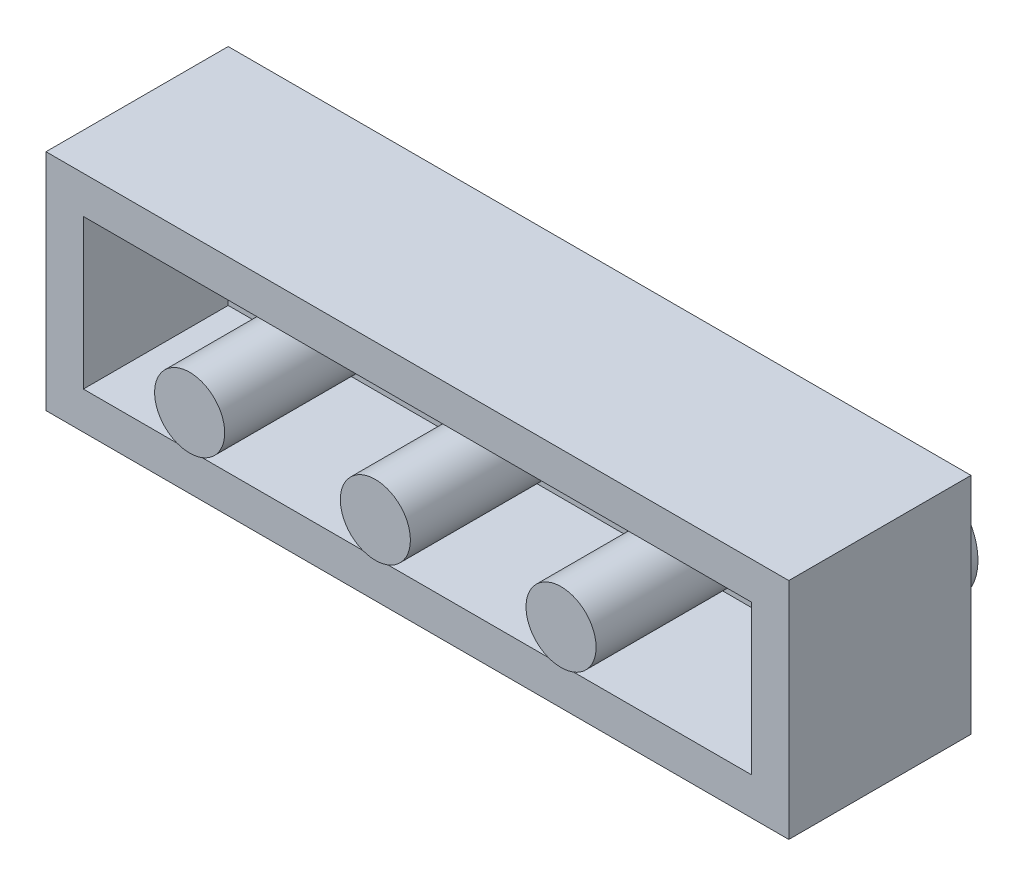
ISO-10303-21;
HEADER;
FILE_DESCRIPTION(('STEP AP214'),'2;1');
FILE_NAME('part.step','',(''),(''),'','','');
FILE_SCHEMA(('AUTOMOTIVE_DESIGN { 1 0 10303 214 1 1 1 1 }'));
ENDSEC;
DATA;
#1=APPLICATION_CONTEXT('core data for automotive mechanical design processes');
#2=APPLICATION_PROTOCOL_DEFINITION('international standard','automotive_design',2000,#1);
#3=PRODUCT_CONTEXT('',#1,'mechanical');
#4=PRODUCT('Part','Part','',(#3));
#5=PRODUCT_RELATED_PRODUCT_CATEGORY('part','',(#4));
#6=PRODUCT_DEFINITION_FORMATION('','',#4);
#7=PRODUCT_DEFINITION_CONTEXT('part definition',#1,'design');
#8=PRODUCT_DEFINITION('design','',#6,#7);
#9=PRODUCT_DEFINITION_SHAPE('','',#8);
#10=(LENGTH_UNIT() NAMED_UNIT(*) SI_UNIT(.MILLI.,.METRE.));
#11=(NAMED_UNIT(*) PLANE_ANGLE_UNIT() SI_UNIT($,.RADIAN.));
#12=(NAMED_UNIT(*) SI_UNIT($,.STERADIAN.) SOLID_ANGLE_UNIT());
#13=UNCERTAINTY_MEASURE_WITH_UNIT(LENGTH_MEASURE(1.E-05),#10,'distance_accuracy_value','');
#14=(GEOMETRIC_REPRESENTATION_CONTEXT(3) GLOBAL_UNCERTAINTY_ASSIGNED_CONTEXT((#13)) GLOBAL_UNIT_ASSIGNED_CONTEXT((#10,
#11,#12)) REPRESENTATION_CONTEXT('',''));
#15=CARTESIAN_POINT('',(0.,0.,0.));
#16=DIRECTION('',(0.,0.,1.));
#17=DIRECTION('',(1.,0.,0.));
#18=AXIS2_PLACEMENT_3D('',#15,#16,#17);
#19=CARTESIAN_POINT('',(12.,0.,-5.7));
#20=DIRECTION('',(0.,0.,-1.));
#21=DIRECTION('',(-1.,0.,0.));
#22=AXIS2_PLACEMENT_3D('',#19,#20,#21);
#23=PLANE('',#22);
#24=CARTESIAN_POINT('',(12.,0.,-5.7));
#25=DIRECTION('',(0.,0.,-1.));
#26=DIRECTION('',(-1.,0.,0.));
#27=AXIS2_PLACEMENT_3D('',#24,#25,#26);
#28=CIRCLE('',#27,2.4);
#29=CARTESIAN_POINT('',(9.6,0.,-5.7));
#30=VERTEX_POINT('',#29);
#31=EDGE_CURVE('E11',#30,#30,#28,.T.);
#32=ORIENTED_EDGE('',*,*,#31,.T.);
#33=EDGE_LOOP('',(#32));
#34=FACE_BOUND('',#33,.T.);
#35=ADVANCED_FACE('F35',(#34),#23,.T.);
#36=CARTESIAN_POINT('',(12.,0.,-5.7));
#37=DIRECTION('',(0.,0.,1.));
#38=DIRECTION('',(1.,0.,0.));
#39=AXIS2_PLACEMENT_3D('',#36,#37,#38);
#40=CYLINDRICAL_SURFACE('',#39,2.4);
#41=ORIENTED_EDGE('',*,*,#31,.F.);
#42=EDGE_LOOP('',(#41));
#43=FACE_BOUND('',#42,.T.);
#44=CARTESIAN_POINT('',(12.,0.,-3.9));
#45=DIRECTION('',(0.,0.,1.));
#46=DIRECTION('',(1.,0.,0.));
#47=AXIS2_PLACEMENT_3D('',#44,#45,#46);
#48=CIRCLE('',#47,2.4);
#49=CARTESIAN_POINT('',(14.4,0.,-3.9));
#50=VERTEX_POINT('',#49);
#51=EDGE_CURVE('E42',#50,#50,#48,.F.);
#52=ORIENTED_EDGE('',*,*,#51,.T.);
#53=EDGE_LOOP('',(#52));
#54=FACE_BOUND('',#53,.T.);
#55=ADVANCED_FACE('F183',(#43,#54),#40,.T.);
#56=CARTESIAN_POINT('',(4.,0.,-5.7));
#57=DIRECTION('',(0.,0.,-1.));
#58=DIRECTION('',(-1.,0.,0.));
#59=AXIS2_PLACEMENT_3D('',#56,#57,#58);
#60=PLANE('',#59);
#61=CARTESIAN_POINT('',(4.,0.,-5.7));
#62=DIRECTION('',(0.,0.,-1.));
#63=DIRECTION('',(-1.,0.,0.));
#64=AXIS2_PLACEMENT_3D('',#61,#62,#63);
#65=CIRCLE('',#64,2.4);
#66=CARTESIAN_POINT('',(1.6,0.,-5.7));
#67=VERTEX_POINT('',#66);
#68=EDGE_CURVE('E178',#67,#67,#65,.T.);
#69=ORIENTED_EDGE('',*,*,#68,.T.);
#70=EDGE_LOOP('',(#69));
#71=FACE_BOUND('',#70,.T.);
#72=ADVANCED_FACE('F208',(#71),#60,.T.);
#73=CARTESIAN_POINT('',(4.,0.,-5.7));
#74=DIRECTION('',(0.,0.,1.));
#75=DIRECTION('',(1.,0.,0.));
#76=AXIS2_PLACEMENT_3D('',#73,#74,#75);
#77=CYLINDRICAL_SURFACE('',#76,2.4);
#78=ORIENTED_EDGE('',*,*,#68,.F.);
#79=EDGE_LOOP('',(#78));
#80=FACE_BOUND('',#79,.T.);
#81=CARTESIAN_POINT('',(4.,0.,-3.9));
#82=DIRECTION('',(0.,0.,1.));
#83=DIRECTION('',(1.,0.,0.));
#84=AXIS2_PLACEMENT_3D('',#81,#82,#83);
#85=CIRCLE('',#84,2.4);
#86=CARTESIAN_POINT('',(6.4,0.,-3.9));
#87=VERTEX_POINT('',#86);
#88=EDGE_CURVE('E175',#87,#87,#85,.F.);
#89=ORIENTED_EDGE('',*,*,#88,.T.);
#90=EDGE_LOOP('',(#89));
#91=FACE_BOUND('',#90,.T.);
#92=ADVANCED_FACE('F214',(#80,#91),#77,.T.);
#93=CARTESIAN_POINT('',(-15.9,4.8,3.9));
#94=DIRECTION('',(0.,0.,-1.));
#95=DIRECTION('',(-1.,0.,0.));
#96=AXIS2_PLACEMENT_3D('',#93,#94,#95);
#97=PLANE('',#96);
#98=DIRECTION('',(1.,0.,0.));
#99=VECTOR('',#98,1.);
#100=CARTESIAN_POINT('',(-15.9,-4.8,3.9));
#101=LINE('',#100,#99);
#102=CARTESIAN_POINT('',(-15.9,-4.8,3.9));
#103=VERTEX_POINT('',#102);
#104=CARTESIAN_POINT('',(15.9,-4.8,3.9));
#105=VERTEX_POINT('',#104);
#106=EDGE_CURVE('E79',#103,#105,#101,.T.);
#107=ORIENTED_EDGE('',*,*,#106,.T.);
#108=DIRECTION('',(0.,-1.,0.));
#109=VECTOR('',#108,1.);
#110=CARTESIAN_POINT('',(15.9,4.8,3.9));
#111=LINE('',#110,#109);
#112=CARTESIAN_POINT('',(15.9,4.8,3.9));
#113=VERTEX_POINT('',#112);
#114=EDGE_CURVE('E152',#113,#105,#111,.T.);
#115=ORIENTED_EDGE('',*,*,#114,.F.);
#116=DIRECTION('',(1.,0.,0.));
#117=VECTOR('',#116,1.);
#118=CARTESIAN_POINT('',(-15.9,4.8,3.9));
#119=LINE('',#118,#117);
#120=CARTESIAN_POINT('',(-15.9,4.8,3.9));
#121=VERTEX_POINT('',#120);
#122=EDGE_CURVE('E58',#121,#113,#119,.T.);
#123=ORIENTED_EDGE('',*,*,#122,.F.);
#124=DIRECTION('',(0.,-1.,0.));
#125=VECTOR('',#124,1.);
#126=CARTESIAN_POINT('',(-15.9,4.8,3.9));
#127=LINE('',#126,#125);
#128=EDGE_CURVE('E162',#121,#103,#127,.T.);
#129=ORIENTED_EDGE('',*,*,#128,.T.);
#130=EDGE_LOOP('',(#107,#115,#123,#129));
#131=FACE_BOUND('',#130,.T.);
#132=DIRECTION('',(1.,0.,0.));
#133=VECTOR('',#132,1.);
#134=CARTESIAN_POINT('',(-15.9,-3.2,3.9));
#135=LINE('',#134,#133);
#136=CARTESIAN_POINT('',(-14.3,-3.2,3.9));
#137=VERTEX_POINT('',#136);
#138=CARTESIAN_POINT('',(14.3,-3.2,3.9));
#139=VERTEX_POINT('',#138);
#140=EDGE_CURVE('E133',#137,#139,#135,.T.);
#141=ORIENTED_EDGE('',*,*,#140,.F.);
#142=DIRECTION('',(0.,-1.,0.));
#143=VECTOR('',#142,1.);
#144=CARTESIAN_POINT('',(-14.3,4.8,3.9));
#145=LINE('',#144,#143);
#146=CARTESIAN_POINT('',(-14.3,3.2,3.9));
#147=VERTEX_POINT('',#146);
#148=EDGE_CURVE('E128',#147,#137,#145,.T.);
#149=ORIENTED_EDGE('',*,*,#148,.F.);
#150=DIRECTION('',(1.,0.,0.));
#151=VECTOR('',#150,1.);
#152=CARTESIAN_POINT('',(-15.9,3.2,3.9));
#153=LINE('',#152,#151);
#154=CARTESIAN_POINT('',(14.3,3.2,3.9));
#155=VERTEX_POINT('',#154);
#156=EDGE_CURVE('E49',#147,#155,#153,.T.);
#157=ORIENTED_EDGE('',*,*,#156,.T.);
#158=DIRECTION('',(0.,-1.,0.));
#159=VECTOR('',#158,1.);
#160=CARTESIAN_POINT('',(14.3,4.8,3.9));
#161=LINE('',#160,#159);
#162=EDGE_CURVE('E141',#155,#139,#161,.T.);
#163=ORIENTED_EDGE('',*,*,#162,.T.);
#164=EDGE_LOOP('',(#141,#149,#157,#163));
#165=FACE_BOUND('',#164,.T.);
#166=ADVANCED_FACE('F198',(#131,#165),#97,.F.);
#167=CARTESIAN_POINT('',(15.9,4.8,-3.9));
#168=DIRECTION('',(-1.,0.,0.));
#169=DIRECTION('',(0.,0.,1.));
#170=AXIS2_PLACEMENT_3D('',#167,#168,#169);
#171=PLANE('',#170);
#172=DIRECTION('',(0.,0.,-1.));
#173=VECTOR('',#172,1.);
#174=CARTESIAN_POINT('',(15.9,-4.8,-3.9));
#175=LINE('',#174,#173);
#176=CARTESIAN_POINT('',(15.9,-4.8,-3.9));
#177=VERTEX_POINT('',#176);
#178=EDGE_CURVE('E153',#105,#177,#175,.T.);
#179=ORIENTED_EDGE('',*,*,#178,.T.);
#180=DIRECTION('',(0.,-1.,0.));
#181=VECTOR('',#180,1.);
#182=CARTESIAN_POINT('',(15.9,4.8,-3.9));
#183=LINE('',#182,#181);
#184=CARTESIAN_POINT('',(15.9,4.8,-3.9));
#185=VERTEX_POINT('',#184);
#186=EDGE_CURVE('E167',#185,#177,#183,.T.);
#187=ORIENTED_EDGE('',*,*,#186,.F.);
#188=DIRECTION('',(0.,0.,-1.));
#189=VECTOR('',#188,1.);
#190=CARTESIAN_POINT('',(15.9,4.8,-3.9));
#191=LINE('',#190,#189);
#192=EDGE_CURVE('E146',#113,#185,#191,.T.);
#193=ORIENTED_EDGE('',*,*,#192,.F.);
#194=ORIENTED_EDGE('',*,*,#114,.T.);
#195=EDGE_LOOP('',(#179,#187,#193,#194));
#196=FACE_BOUND('',#195,.T.);
#197=ADVANCED_FACE('F188',(#196),#171,.F.);
#198=CARTESIAN_POINT('',(-15.9,4.8,-3.9));
#199=DIRECTION('',(0.,0.,1.));
#200=DIRECTION('',(1.,0.,0.));
#201=AXIS2_PLACEMENT_3D('',#198,#199,#200);
#202=PLANE('',#201);
#203=CARTESIAN_POINT('',(-4.,0.,-3.9));
#204=DIRECTION('',(0.,0.,1.));
#205=DIRECTION('',(1.,0.,0.));
#206=AXIS2_PLACEMENT_3D('',#203,#204,#205);
#207=CIRCLE('',#206,2.4);
#208=CARTESIAN_POINT('',(-1.6,0.,-3.9));
#209=VERTEX_POINT('',#208);
#210=EDGE_CURVE('E172',#209,#209,#207,.F.);
#211=ORIENTED_EDGE('',*,*,#210,.F.);
#212=EDGE_LOOP('',(#211));
#213=FACE_BOUND('',#212,.T.);
#214=CARTESIAN_POINT('',(-12.,0.,-3.9));
#215=DIRECTION('',(0.,0.,1.));
#216=DIRECTION('',(1.,0.,0.));
#217=AXIS2_PLACEMENT_3D('',#214,#215,#216);
#218=CIRCLE('',#217,2.4);
#219=CARTESIAN_POINT('',(-9.6,0.,-3.9));
#220=VERTEX_POINT('',#219);
#221=EDGE_CURVE('E169',#220,#220,#218,.F.);
#222=ORIENTED_EDGE('',*,*,#221,.F.);
#223=EDGE_LOOP('',(#222));
#224=FACE_BOUND('',#223,.T.);
#225=DIRECTION('',(-1.,0.,0.));
#226=VECTOR('',#225,1.);
#227=CARTESIAN_POINT('',(-15.9,-4.8,-3.9));
#228=LINE('',#227,#226);
#229=CARTESIAN_POINT('',(-15.9,-4.8,-3.9));
#230=VERTEX_POINT('',#229);
#231=EDGE_CURVE('E156',#177,#230,#228,.T.);
#232=ORIENTED_EDGE('',*,*,#231,.T.);
#233=DIRECTION('',(0.,-1.,0.));
#234=VECTOR('',#233,1.);
#235=CARTESIAN_POINT('',(-15.9,4.8,-3.9));
#236=LINE('',#235,#234);
#237=CARTESIAN_POINT('',(-15.9,4.8,-3.9));
#238=VERTEX_POINT('',#237);
#239=EDGE_CURVE('E164',#238,#230,#236,.T.);
#240=ORIENTED_EDGE('',*,*,#239,.F.);
#241=DIRECTION('',(-1.,0.,0.));
#242=VECTOR('',#241,1.);
#243=CARTESIAN_POINT('',(-15.9,4.8,-3.9));
#244=LINE('',#243,#242);
#245=EDGE_CURVE('E87',#185,#238,#244,.T.);
#246=ORIENTED_EDGE('',*,*,#245,.F.);
#247=ORIENTED_EDGE('',*,*,#186,.T.);
#248=EDGE_LOOP('',(#232,#240,#246,#247));
#249=FACE_BOUND('',#248,.T.);
#250=ORIENTED_EDGE('',*,*,#88,.F.);
#251=EDGE_LOOP('',(#250));
#252=FACE_BOUND('',#251,.T.);
#253=ORIENTED_EDGE('',*,*,#51,.F.);
#254=EDGE_LOOP('',(#253));
#255=FACE_BOUND('',#254,.T.);
#256=ADVANCED_FACE('F185',(#213,#224,#249,#252,#255),#202,.F.);
#257=CARTESIAN_POINT('',(-15.9,4.8,-3.9));
#258=DIRECTION('',(1.,0.,0.));
#259=DIRECTION('',(0.,0.,-1.));
#260=AXIS2_PLACEMENT_3D('',#257,#258,#259);
#261=PLANE('',#260);
#262=DIRECTION('',(0.,0.,1.));
#263=VECTOR('',#262,1.);
#264=CARTESIAN_POINT('',(-15.9,-4.8,-3.9));
#265=LINE('',#264,#263);
#266=EDGE_CURVE('E158',#230,#103,#265,.T.);
#267=ORIENTED_EDGE('',*,*,#266,.T.);
#268=ORIENTED_EDGE('',*,*,#128,.F.);
#269=DIRECTION('',(0.,0.,1.));
#270=VECTOR('',#269,1.);
#271=CARTESIAN_POINT('',(-15.9,4.8,-3.9));
#272=LINE('',#271,#270);
#273=EDGE_CURVE('E149',#238,#121,#272,.T.);
#274=ORIENTED_EDGE('',*,*,#273,.F.);
#275=ORIENTED_EDGE('',*,*,#239,.T.);
#276=EDGE_LOOP('',(#267,#268,#274,#275));
#277=FACE_BOUND('',#276,.T.);
#278=ADVANCED_FACE('F187',(#277),#261,.F.);
#279=CARTESIAN_POINT('',(0.,4.8,0.));
#280=DIRECTION('',(0.,1.,0.));
#281=DIRECTION('',(0.,0.,1.));
#282=AXIS2_PLACEMENT_3D('',#279,#280,#281);
#283=PLANE('',#282);
#284=ORIENTED_EDGE('',*,*,#192,.T.);
#285=ORIENTED_EDGE('',*,*,#245,.T.);
#286=ORIENTED_EDGE('',*,*,#273,.T.);
#287=ORIENTED_EDGE('',*,*,#122,.T.);
#288=EDGE_LOOP('',(#284,#285,#286,#287));
#289=FACE_BOUND('',#288,.T.);
#290=ADVANCED_FACE('F195',(#289),#283,.T.);
#291=CARTESIAN_POINT('',(0.,-4.8,0.));
#292=DIRECTION('',(0.,1.,0.));
#293=DIRECTION('',(0.,0.,1.));
#294=AXIS2_PLACEMENT_3D('',#291,#292,#293);
#295=PLANE('',#294);
#296=ORIENTED_EDGE('',*,*,#178,.F.);
#297=ORIENTED_EDGE('',*,*,#106,.F.);
#298=ORIENTED_EDGE('',*,*,#266,.F.);
#299=ORIENTED_EDGE('',*,*,#231,.F.);
#300=EDGE_LOOP('',(#296,#297,#298,#299));
#301=FACE_BOUND('',#300,.T.);
#302=ADVANCED_FACE('F232',(#301),#295,.F.);
#303=CARTESIAN_POINT('',(14.3,4.8,-3.9));
#304=DIRECTION('',(-1.,0.,0.));
#305=DIRECTION('',(0.,0.,1.));
#306=AXIS2_PLACEMENT_3D('',#303,#304,#305);
#307=PLANE('',#306);
#308=DIRECTION('',(0.,0.,-1.));
#309=VECTOR('',#308,1.);
#310=CARTESIAN_POINT('',(14.3,-3.2,-3.9));
#311=LINE('',#310,#309);
#312=CARTESIAN_POINT('',(14.3,-3.2,-2.3));
#313=VERTEX_POINT('',#312);
#314=EDGE_CURVE('E117',#139,#313,#311,.T.);
#315=ORIENTED_EDGE('',*,*,#314,.F.);
#316=ORIENTED_EDGE('',*,*,#162,.F.);
#317=DIRECTION('',(0.,0.,-1.));
#318=VECTOR('',#317,1.);
#319=CARTESIAN_POINT('',(14.3,3.2,-3.9));
#320=LINE('',#319,#318);
#321=CARTESIAN_POINT('',(14.3,3.2,-2.3));
#322=VERTEX_POINT('',#321);
#323=EDGE_CURVE('E135',#155,#322,#320,.T.);
#324=ORIENTED_EDGE('',*,*,#323,.T.);
#325=DIRECTION('',(0.,-1.,0.));
#326=VECTOR('',#325,1.);
#327=CARTESIAN_POINT('',(14.3,4.8,-2.3));
#328=LINE('',#327,#326);
#329=EDGE_CURVE('E127',#322,#313,#328,.T.);
#330=ORIENTED_EDGE('',*,*,#329,.T.);
#331=EDGE_LOOP('',(#315,#316,#324,#330));
#332=FACE_BOUND('',#331,.T.);
#333=ADVANCED_FACE('F235',(#332),#307,.T.);
#334=CARTESIAN_POINT('',(-15.9,4.8,-2.3));
#335=DIRECTION('',(0.,0.,1.));
#336=DIRECTION('',(1.,0.,0.));
#337=AXIS2_PLACEMENT_3D('',#334,#335,#336);
#338=PLANE('',#337);
#339=CARTESIAN_POINT('',(7.95,0.,-2.3));
#340=DIRECTION('',(0.,0.,1.));
#341=DIRECTION('',(1.,0.,0.));
#342=AXIS2_PLACEMENT_3D('',#339,#340,#341);
#343=CIRCLE('',#342,1.5);
#344=CARTESIAN_POINT('',(9.45,0.,-2.3));
#345=VERTEX_POINT('',#344);
#346=EDGE_CURVE('E297',#345,#345,#343,.T.);
#347=ORIENTED_EDGE('',*,*,#346,.F.);
#348=EDGE_LOOP('',(#347));
#349=FACE_BOUND('',#348,.T.);
#350=CARTESIAN_POINT('',(0.,0.,-2.3));
#351=DIRECTION('',(0.,0.,1.));
#352=DIRECTION('',(1.,0.,0.));
#353=AXIS2_PLACEMENT_3D('',#350,#351,#352);
#354=CIRCLE('',#353,1.5);
#355=CARTESIAN_POINT('',(1.5,0.,-2.3));
#356=VERTEX_POINT('',#355);
#357=EDGE_CURVE('E296',#356,#356,#354,.T.);
#358=ORIENTED_EDGE('',*,*,#357,.F.);
#359=EDGE_LOOP('',(#358));
#360=FACE_BOUND('',#359,.T.);
#361=CARTESIAN_POINT('',(-7.95,0.,-2.3));
#362=DIRECTION('',(0.,0.,1.));
#363=DIRECTION('',(1.,0.,0.));
#364=AXIS2_PLACEMENT_3D('',#361,#362,#363);
#365=CIRCLE('',#364,1.5);
#366=CARTESIAN_POINT('',(-6.45,0.,-2.3));
#367=VERTEX_POINT('',#366);
#368=EDGE_CURVE('E306',#367,#367,#365,.T.);
#369=ORIENTED_EDGE('',*,*,#368,.F.);
#370=EDGE_LOOP('',(#369));
#371=FACE_BOUND('',#370,.T.);
#372=DIRECTION('',(-1.,0.,0.));
#373=VECTOR('',#372,1.);
#374=CARTESIAN_POINT('',(-15.9,-3.2,-2.3));
#375=LINE('',#374,#373);
#376=CARTESIAN_POINT('',(-14.3,-3.2,-2.3));
#377=VERTEX_POINT('',#376);
#378=EDGE_CURVE('E110',#313,#377,#375,.T.);
#379=ORIENTED_EDGE('',*,*,#378,.F.);
#380=ORIENTED_EDGE('',*,*,#329,.F.);
#381=DIRECTION('',(-1.,0.,0.));
#382=VECTOR('',#381,1.);
#383=CARTESIAN_POINT('',(-15.9,3.2,-2.3));
#384=LINE('',#383,#382);
#385=CARTESIAN_POINT('',(-14.3,3.2,-2.3));
#386=VERTEX_POINT('',#385);
#387=EDGE_CURVE('E125',#322,#386,#384,.T.);
#388=ORIENTED_EDGE('',*,*,#387,.T.);
#389=DIRECTION('',(0.,-1.,0.));
#390=VECTOR('',#389,1.);
#391=CARTESIAN_POINT('',(-14.3,4.8,-2.3));
#392=LINE('',#391,#390);
#393=EDGE_CURVE('E123',#386,#377,#392,.T.);
#394=ORIENTED_EDGE('',*,*,#393,.T.);
#395=EDGE_LOOP('',(#379,#380,#388,#394));
#396=FACE_BOUND('',#395,.T.);
#397=ADVANCED_FACE('F124',(#349,#360,#371,#396),#338,.T.);
#398=CARTESIAN_POINT('',(-14.3,4.8,-3.9));
#399=DIRECTION('',(1.,0.,0.));
#400=DIRECTION('',(0.,0.,-1.));
#401=AXIS2_PLACEMENT_3D('',#398,#399,#400);
#402=PLANE('',#401);
#403=DIRECTION('',(0.,0.,1.));
#404=VECTOR('',#403,1.);
#405=CARTESIAN_POINT('',(-14.3,-3.2,-3.9));
#406=LINE('',#405,#404);
#407=EDGE_CURVE('E114',#377,#137,#406,.T.);
#408=ORIENTED_EDGE('',*,*,#407,.F.);
#409=ORIENTED_EDGE('',*,*,#393,.F.);
#410=DIRECTION('',(0.,0.,1.));
#411=VECTOR('',#410,1.);
#412=CARTESIAN_POINT('',(-14.3,3.2,-3.9));
#413=LINE('',#412,#411);
#414=EDGE_CURVE('E139',#386,#147,#413,.T.);
#415=ORIENTED_EDGE('',*,*,#414,.T.);
#416=ORIENTED_EDGE('',*,*,#148,.T.);
#417=EDGE_LOOP('',(#408,#409,#415,#416));
#418=FACE_BOUND('',#417,.T.);
#419=ADVANCED_FACE('F130',(#418),#402,.T.);
#420=CARTESIAN_POINT('',(0.,3.2,0.));
#421=DIRECTION('',(0.,1.,0.));
#422=DIRECTION('',(0.,0.,1.));
#423=AXIS2_PLACEMENT_3D('',#420,#421,#422);
#424=PLANE('',#423);
#425=ORIENTED_EDGE('',*,*,#323,.F.);
#426=ORIENTED_EDGE('',*,*,#156,.F.);
#427=ORIENTED_EDGE('',*,*,#414,.F.);
#428=ORIENTED_EDGE('',*,*,#387,.F.);
#429=EDGE_LOOP('',(#425,#426,#427,#428));
#430=FACE_BOUND('',#429,.T.);
#431=ADVANCED_FACE('F242',(#430),#424,.F.);
#432=CARTESIAN_POINT('',(0.,-3.2,0.));
#433=DIRECTION('',(0.,1.,0.));
#434=DIRECTION('',(0.,0.,1.));
#435=AXIS2_PLACEMENT_3D('',#432,#433,#434);
#436=PLANE('',#435);
#437=ORIENTED_EDGE('',*,*,#314,.T.);
#438=ORIENTED_EDGE('',*,*,#378,.T.);
#439=ORIENTED_EDGE('',*,*,#407,.T.);
#440=ORIENTED_EDGE('',*,*,#140,.T.);
#441=EDGE_LOOP('',(#437,#438,#439,#440));
#442=FACE_BOUND('',#441,.T.);
#443=ADVANCED_FACE('F112',(#442),#436,.T.);
#444=CARTESIAN_POINT('',(-12.,0.,-5.7));
#445=DIRECTION('',(0.,0.,1.));
#446=DIRECTION('',(1.,0.,0.));
#447=AXIS2_PLACEMENT_3D('',#444,#445,#446);
#448=CYLINDRICAL_SURFACE('',#447,2.4);
#449=CARTESIAN_POINT('',(-12.,0.,-5.7));
#450=DIRECTION('',(0.,0.,-1.));
#451=DIRECTION('',(-1.,0.,0.));
#452=AXIS2_PLACEMENT_3D('',#449,#450,#451);
#453=CIRCLE('',#452,2.4);
#454=CARTESIAN_POINT('',(-14.4,0.,-5.7));
#455=VERTEX_POINT('',#454);
#456=EDGE_CURVE('E316',#455,#455,#453,.T.);
#457=ORIENTED_EDGE('',*,*,#456,.F.);
#458=EDGE_LOOP('',(#457));
#459=FACE_BOUND('',#458,.T.);
#460=ORIENTED_EDGE('',*,*,#221,.T.);
#461=EDGE_LOOP('',(#460));
#462=FACE_BOUND('',#461,.T.);
#463=ADVANCED_FACE('F241',(#459,#462),#448,.T.);
#464=CARTESIAN_POINT('',(-12.,0.,-5.7));
#465=DIRECTION('',(0.,0.,-1.));
#466=DIRECTION('',(-1.,0.,0.));
#467=AXIS2_PLACEMENT_3D('',#464,#465,#466);
#468=PLANE('',#467);
#469=ORIENTED_EDGE('',*,*,#456,.T.);
#470=EDGE_LOOP('',(#469));
#471=FACE_BOUND('',#470,.T.);
#472=ADVANCED_FACE('F255',(#471),#468,.T.);
#473=CARTESIAN_POINT('',(-4.,0.,-5.7));
#474=DIRECTION('',(0.,0.,1.));
#475=DIRECTION('',(1.,0.,0.));
#476=AXIS2_PLACEMENT_3D('',#473,#474,#475);
#477=CYLINDRICAL_SURFACE('',#476,2.4);
#478=CARTESIAN_POINT('',(-4.,0.,-5.7));
#479=DIRECTION('',(0.,0.,-1.));
#480=DIRECTION('',(-1.,0.,0.));
#481=AXIS2_PLACEMENT_3D('',#478,#479,#480);
#482=CIRCLE('',#481,2.4);
#483=CARTESIAN_POINT('',(-6.4,0.,-5.7));
#484=VERTEX_POINT('',#483);
#485=EDGE_CURVE('E311',#484,#484,#482,.T.);
#486=ORIENTED_EDGE('',*,*,#485,.F.);
#487=EDGE_LOOP('',(#486));
#488=FACE_BOUND('',#487,.T.);
#489=ORIENTED_EDGE('',*,*,#210,.T.);
#490=EDGE_LOOP('',(#489));
#491=FACE_BOUND('',#490,.T.);
#492=ADVANCED_FACE('F259',(#488,#491),#477,.T.);
#493=CARTESIAN_POINT('',(-4.,0.,-5.7));
#494=DIRECTION('',(0.,0.,-1.));
#495=DIRECTION('',(-1.,0.,0.));
#496=AXIS2_PLACEMENT_3D('',#493,#494,#495);
#497=PLANE('',#496);
#498=ORIENTED_EDGE('',*,*,#485,.T.);
#499=EDGE_LOOP('',(#498));
#500=FACE_BOUND('',#499,.T.);
#501=ADVANCED_FACE('F263',(#500),#497,.T.);
#502=CARTESIAN_POINT('',(-7.95,0.,5.7));
#503=DIRECTION('',(0.,0.,-1.));
#504=DIRECTION('',(-1.,0.,0.));
#505=AXIS2_PLACEMENT_3D('',#502,#503,#504);
#506=CYLINDRICAL_SURFACE('',#505,1.5);
#507=CARTESIAN_POINT('',(-7.95,0.,5.7));
#508=DIRECTION('',(0.,0.,1.));
#509=DIRECTION('',(1.,0.,0.));
#510=AXIS2_PLACEMENT_3D('',#507,#508,#509);
#511=CIRCLE('',#510,1.5);
#512=CARTESIAN_POINT('',(-6.45,0.,5.7));
#513=VERTEX_POINT('',#512);
#514=EDGE_CURVE('E308',#513,#513,#511,.T.);
#515=ORIENTED_EDGE('',*,*,#514,.F.);
#516=EDGE_LOOP('',(#515));
#517=FACE_BOUND('',#516,.T.);
#518=ORIENTED_EDGE('',*,*,#368,.T.);
#519=EDGE_LOOP('',(#518));
#520=FACE_BOUND('',#519,.T.);
#521=ADVANCED_FACE('F267',(#517,#520),#506,.T.);
#522=CARTESIAN_POINT('',(-7.95,0.,5.7));
#523=DIRECTION('',(0.,0.,1.));
#524=DIRECTION('',(1.,0.,0.));
#525=AXIS2_PLACEMENT_3D('',#522,#523,#524);
#526=PLANE('',#525);
#527=ORIENTED_EDGE('',*,*,#514,.T.);
#528=EDGE_LOOP('',(#527));
#529=FACE_BOUND('',#528,.T.);
#530=ADVANCED_FACE('F271',(#529),#526,.T.);
#531=CARTESIAN_POINT('',(0.,0.,5.7));
#532=DIRECTION('',(0.,0.,-1.));
#533=DIRECTION('',(-1.,0.,0.));
#534=AXIS2_PLACEMENT_3D('',#531,#532,#533);
#535=CYLINDRICAL_SURFACE('',#534,1.5);
#536=CARTESIAN_POINT('',(0.,0.,5.7));
#537=DIRECTION('',(0.,0.,1.));
#538=DIRECTION('',(1.,0.,0.));
#539=AXIS2_PLACEMENT_3D('',#536,#537,#538);
#540=CIRCLE('',#539,1.5);
#541=CARTESIAN_POINT('',(1.5,0.,5.7));
#542=VERTEX_POINT('',#541);
#543=EDGE_CURVE('E300',#542,#542,#540,.T.);
#544=ORIENTED_EDGE('',*,*,#543,.F.);
#545=EDGE_LOOP('',(#544));
#546=FACE_BOUND('',#545,.T.);
#547=ORIENTED_EDGE('',*,*,#357,.T.);
#548=EDGE_LOOP('',(#547));
#549=FACE_BOUND('',#548,.T.);
#550=ADVANCED_FACE('F275',(#546,#549),#535,.T.);
#551=CARTESIAN_POINT('',(0.,0.,5.7));
#552=DIRECTION('',(0.,0.,1.));
#553=DIRECTION('',(1.,0.,0.));
#554=AXIS2_PLACEMENT_3D('',#551,#552,#553);
#555=PLANE('',#554);
#556=ORIENTED_EDGE('',*,*,#543,.T.);
#557=EDGE_LOOP('',(#556));
#558=FACE_BOUND('',#557,.T.);
#559=ADVANCED_FACE('F279',(#558),#555,.T.);
#560=CARTESIAN_POINT('',(7.95,0.,5.7));
#561=DIRECTION('',(0.,0.,-1.));
#562=DIRECTION('',(-1.,0.,0.));
#563=AXIS2_PLACEMENT_3D('',#560,#561,#562);
#564=CYLINDRICAL_SURFACE('',#563,1.5);
#565=CARTESIAN_POINT('',(7.95,0.,5.7));
#566=DIRECTION('',(0.,0.,1.));
#567=DIRECTION('',(1.,0.,0.));
#568=AXIS2_PLACEMENT_3D('',#565,#566,#567);
#569=CIRCLE('',#568,1.5);
#570=CARTESIAN_POINT('',(9.45,0.,5.7));
#571=VERTEX_POINT('',#570);
#572=EDGE_CURVE('E295',#571,#571,#569,.T.);
#573=ORIENTED_EDGE('',*,*,#572,.F.);
#574=EDGE_LOOP('',(#573));
#575=FACE_BOUND('',#574,.T.);
#576=ORIENTED_EDGE('',*,*,#346,.T.);
#577=EDGE_LOOP('',(#576));
#578=FACE_BOUND('',#577,.T.);
#579=ADVANCED_FACE('F283',(#575,#578),#564,.T.);
#580=CARTESIAN_POINT('',(7.95,0.,5.7));
#581=DIRECTION('',(0.,0.,1.));
#582=DIRECTION('',(1.,0.,0.));
#583=AXIS2_PLACEMENT_3D('',#580,#581,#582);
#584=PLANE('',#583);
#585=ORIENTED_EDGE('',*,*,#572,.T.);
#586=EDGE_LOOP('',(#585));
#587=FACE_BOUND('',#586,.T.);
#588=ADVANCED_FACE('F287',(#587),#584,.T.);
#589=CLOSED_SHELL('',(#35,#55,#72,#92,#166,#197,#256,#278,#290,#302,#333,#397,#419,#431,#443,
#463,#472,#492,#501,#521,#530,#550,#559,#579,#588));
#590=MANIFOLD_SOLID_BREP('B2',#589);
#591=ADVANCED_BREP_SHAPE_REPRESENTATION('',(#18,#590),#14);
#592=SHAPE_DEFINITION_REPRESENTATION(#9,#591);
ENDSEC;
END-ISO-10303-21;
